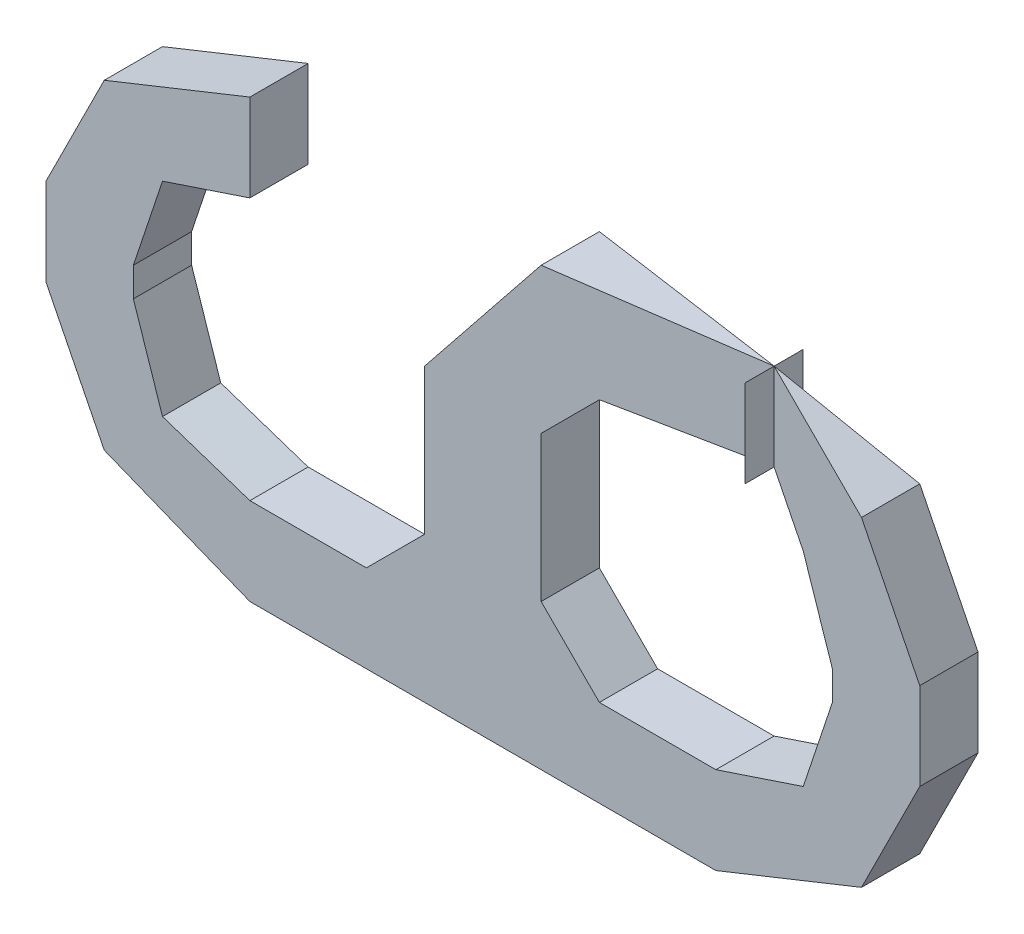
ISO-10303-21;
HEADER;
FILE_DESCRIPTION(('STEP AP214'),'2;1');
FILE_NAME('part.step','',(''),(''),'','','');
FILE_SCHEMA(('AUTOMOTIVE_DESIGN { 1 0 10303 214 1 1 1 1 }'));
ENDSEC;
DATA;
#1=APPLICATION_CONTEXT('core data for automotive mechanical design processes');
#2=APPLICATION_PROTOCOL_DEFINITION('international standard','automotive_design',2000,#1);
#3=PRODUCT_CONTEXT('',#1,'mechanical');
#4=PRODUCT('Part','Part','',(#3));
#5=PRODUCT_RELATED_PRODUCT_CATEGORY('part','',(#4));
#6=PRODUCT_DEFINITION_FORMATION('','',#4);
#7=PRODUCT_DEFINITION_CONTEXT('part definition',#1,'design');
#8=PRODUCT_DEFINITION('design','',#6,#7);
#9=PRODUCT_DEFINITION_SHAPE('','',#8);
#10=(LENGTH_UNIT() NAMED_UNIT(*) SI_UNIT(.MILLI.,.METRE.));
#11=(NAMED_UNIT(*) PLANE_ANGLE_UNIT() SI_UNIT($,.RADIAN.));
#12=(NAMED_UNIT(*) SI_UNIT($,.STERADIAN.) SOLID_ANGLE_UNIT());
#13=UNCERTAINTY_MEASURE_WITH_UNIT(LENGTH_MEASURE(1.E-05),#10,'distance_accuracy_value','');
#14=(GEOMETRIC_REPRESENTATION_CONTEXT(3) GLOBAL_UNCERTAINTY_ASSIGNED_CONTEXT((#13)) GLOBAL_UNIT_ASSIGNED_CONTEXT((#10,
#11,#12)) REPRESENTATION_CONTEXT('',''));
#15=CARTESIAN_POINT('',(0.,0.,0.));
#16=DIRECTION('',(0.,0.,1.));
#17=DIRECTION('',(1.,0.,0.));
#18=AXIS2_PLACEMENT_3D('',#15,#16,#17);
#19=CARTESIAN_POINT('',(-0.1016,0.09524999999999,0.));
#20=DIRECTION('',(0.,0.,-1.));
#21=DIRECTION('',(-1.,0.,0.));
#22=AXIS2_PLACEMENT_3D('',#19,#20,#21);
#23=PLANE('',#22);
#24=DIRECTION('',(0.,1.,0.));
#25=VECTOR('',#24,1.);
#26=CARTESIAN_POINT('',(-0.0254,0.09524999999999,0.));
#27=LINE('',#26,#25);
#28=CARTESIAN_POINT('',(-0.0254,-0.03174999999999,0.));
#29=VERTEX_POINT('',#28);
#30=CARTESIAN_POINT('',(-0.0254000000000053,0.0317500000000285,0.));
#31=VERTEX_POINT('',#30);
#32=EDGE_CURVE('P0_E340',#29,#31,#27,.T.);
#33=ORIENTED_EDGE('',*,*,#32,.T.);
#34=DIRECTION('',(0.624695047554529,0.780868809442946,0.));
#35=VECTOR('',#34,1.);
#36=CARTESIAN_POINT('',(-0.0254,0.03175000000002,0.));
#37=LINE('',#36,#35);
#38=CARTESIAN_POINT('',(0.02539999999999,0.09524999999999,0.));
#39=VERTEX_POINT('',#38);
#40=EDGE_CURVE('P0_E335',#31,#39,#37,.T.);
#41=ORIENTED_EDGE('',*,*,#40,.T.);
#42=DIRECTION('',(-1.,0.,0.));
#43=VECTOR('',#42,1.);
#44=CARTESIAN_POINT('',(-0.1016,0.09524999999999,0.));
#45=LINE('',#44,#43);
#46=CARTESIAN_POINT('',(0.114300000000001,0.095249999999992,0.0127));
#47=VERTEX_POINT('',#46);
#48=EDGE_CURVE('P0_E400',#39,#47,#45,.F.);
#49=ORIENTED_EDGE('',*,*,#48,.T.);
#50=DIRECTION('',(0.894427190999986,-0.447213595499817,0.));
#51=VECTOR('',#50,1.);
#52=CARTESIAN_POINT('',(0.1143,0.09524999999999,0.));
#53=LINE('',#52,#51);
#54=CARTESIAN_POINT('',(0.165099999999998,0.0698499999999998,0.));
#55=VERTEX_POINT('',#54);
#56=EDGE_CURVE('P0_E398',#47,#55,#53,.T.);
#57=ORIENTED_EDGE('',*,*,#56,.T.);
#58=DIRECTION('',(0.447213595499887,-0.894427190999951,0.));
#59=VECTOR('',#58,1.);
#60=CARTESIAN_POINT('',(0.1651,0.06985,0.));
#61=LINE('',#60,#59);
#62=CARTESIAN_POINT('',(0.1905,0.01904999999999,0.));
#63=VERTEX_POINT('',#62);
#64=EDGE_CURVE('P0_E395',#55,#63,#61,.T.);
#65=ORIENTED_EDGE('',*,*,#64,.T.);
#66=DIRECTION('',(0.,1.,0.));
#67=VECTOR('',#66,1.);
#68=CARTESIAN_POINT('',(0.1905,0.09524999999999,0.));
#69=LINE('',#68,#67);
#70=CARTESIAN_POINT('',(0.190500000000001,-0.019049999999991,0.));
#71=VERTEX_POINT('',#70);
#72=EDGE_CURVE('P0_E392',#63,#71,#69,.F.);
#73=ORIENTED_EDGE('',*,*,#72,.T.);
#74=DIRECTION('',(-0.447213595499887,-0.894427190999951,0.));
#75=VECTOR('',#74,1.);
#76=CARTESIAN_POINT('',(0.1905,-0.01904999999999,0.));
#77=LINE('',#76,#75);
#78=CARTESIAN_POINT('',(0.1651,-0.0698499999999965,0.));
#79=VERTEX_POINT('',#78);
#80=EDGE_CURVE('P0_E389',#71,#79,#77,.T.);
#81=ORIENTED_EDGE('',*,*,#80,.T.);
#82=DIRECTION('',(-0.92847669088531,-0.371390676353978,0.));
#83=VECTOR('',#82,1.);
#84=CARTESIAN_POINT('',(0.1651,-0.06985,0.));
#85=LINE('',#84,#83);
#86=CARTESIAN_POINT('',(0.1016,-0.09524999999999,0.));
#87=VERTEX_POINT('',#86);
#88=EDGE_CURVE('P0_E386',#79,#87,#85,.T.);
#89=ORIENTED_EDGE('',*,*,#88,.T.);
#90=DIRECTION('',(-1.,0.,0.));
#91=VECTOR('',#90,1.);
#92=CARTESIAN_POINT('',(-0.1016,-0.09524999999999,0.));
#93=LINE('',#92,#91);
#94=CARTESIAN_POINT('',(-0.101600000000002,-0.0952499999999921,0.));
#95=VERTEX_POINT('',#94);
#96=EDGE_CURVE('P0_E383',#87,#95,#93,.T.);
#97=ORIENTED_EDGE('',*,*,#96,.T.);
#98=DIRECTION('',(-0.92847669088531,0.371390676353978,0.));
#99=VECTOR('',#98,1.);
#100=CARTESIAN_POINT('',(-0.1016,-0.09524999999999,0.));
#101=LINE('',#100,#99);
#102=CARTESIAN_POINT('',(-0.165099999999998,-0.0698499999999998,0.));
#103=VERTEX_POINT('',#102);
#104=EDGE_CURVE('P0_E380',#95,#103,#101,.T.);
#105=ORIENTED_EDGE('',*,*,#104,.T.);
#106=DIRECTION('',(-0.447213595499888,0.894427190999951,0.));
#107=VECTOR('',#106,1.);
#108=CARTESIAN_POINT('',(-0.1651,-0.06985,0.));
#109=LINE('',#108,#107);
#110=CARTESIAN_POINT('',(-0.1905,-0.01904999999999,0.));
#111=VERTEX_POINT('',#110);
#112=EDGE_CURVE('P0_E377',#103,#111,#109,.T.);
#113=ORIENTED_EDGE('',*,*,#112,.T.);
#114=DIRECTION('',(0.,1.,0.));
#115=VECTOR('',#114,1.);
#116=CARTESIAN_POINT('',(-0.1905,0.09524999999999,0.));
#117=LINE('',#116,#115);
#118=CARTESIAN_POINT('',(-0.190500000000001,0.019049999999991,0.));
#119=VERTEX_POINT('',#118);
#120=EDGE_CURVE('P0_E374',#111,#119,#117,.T.);
#121=ORIENTED_EDGE('',*,*,#120,.T.);
#122=DIRECTION('',(0.447213595499888,0.894427190999951,0.));
#123=VECTOR('',#122,1.);
#124=CARTESIAN_POINT('',(-0.1905,0.01904999999999,0.));
#125=LINE('',#124,#123);
#126=CARTESIAN_POINT('',(-0.1651,0.0698499999999965,0.));
#127=VERTEX_POINT('',#126);
#128=EDGE_CURVE('P0_E371',#119,#127,#125,.T.);
#129=ORIENTED_EDGE('',*,*,#128,.T.);
#130=DIRECTION('',(0.92847669088531,0.371390676353978,0.));
#131=VECTOR('',#130,1.);
#132=CARTESIAN_POINT('',(-0.1651,0.06985,0.));
#133=LINE('',#132,#131);
#134=CARTESIAN_POINT('',(-0.1016,0.09524999999999,0.));
#135=VERTEX_POINT('',#134);
#136=EDGE_CURVE('P0_E368',#127,#135,#133,.T.);
#137=ORIENTED_EDGE('',*,*,#136,.T.);
#138=DIRECTION('',(0.,1.,0.));
#139=VECTOR('',#138,1.);
#140=CARTESIAN_POINT('',(-0.1016,0.09524999999999,0.));
#141=LINE('',#140,#139);
#142=CARTESIAN_POINT('',(-0.1016,0.05715000000001,0.));
#143=VERTEX_POINT('',#142);
#144=EDGE_CURVE('P0_E365',#135,#143,#141,.F.);
#145=ORIENTED_EDGE('',*,*,#144,.T.);
#146=DIRECTION('',(-0.948683298050514,-0.316227766016838,0.));
#147=VECTOR('',#146,1.);
#148=CARTESIAN_POINT('',(-0.1016,0.05715000000001,0.));
#149=LINE('',#148,#147);
#150=CARTESIAN_POINT('',(-0.139699999999998,0.0444500000000099,0.));
#151=VERTEX_POINT('',#150);
#152=EDGE_CURVE('P0_E362',#143,#151,#149,.T.);
#153=ORIENTED_EDGE('',*,*,#152,.T.);
#154=DIRECTION('',(-0.316227766016749,-0.948683298050543,0.));
#155=VECTOR('',#154,1.);
#156=CARTESIAN_POINT('',(-0.1397,0.04445000000001,0.));
#157=LINE('',#156,#155);
#158=CARTESIAN_POINT('',(-0.1524,0.00634999999999801,0.));
#159=VERTEX_POINT('',#158);
#160=EDGE_CURVE('P0_E359',#151,#159,#157,.T.);
#161=ORIENTED_EDGE('',*,*,#160,.T.);
#162=DIRECTION('',(0.,1.,0.));
#163=VECTOR('',#162,1.);
#164=CARTESIAN_POINT('',(-0.1524,0.09524999999999,0.));
#165=LINE('',#164,#163);
#166=CARTESIAN_POINT('',(-0.152399999999999,-0.00634999999999722,0.));
#167=VERTEX_POINT('',#166);
#168=EDGE_CURVE('P0_E356',#159,#167,#165,.F.);
#169=ORIENTED_EDGE('',*,*,#168,.T.);
#170=DIRECTION('',(0.316227766016973,-0.948683298050469,0.));
#171=VECTOR('',#170,1.);
#172=CARTESIAN_POINT('',(-0.1524,-0.006349999999998,0.));
#173=LINE('',#172,#171);
#174=CARTESIAN_POINT('',(-0.1397,-0.0444499999999867,0.));
#175=VERTEX_POINT('',#174);
#176=EDGE_CURVE('P0_E353',#167,#175,#173,.T.);
#177=ORIENTED_EDGE('',*,*,#176,.T.);
#178=DIRECTION('',(0.94868329805029,-0.31622776601751,0.));
#179=VECTOR('',#178,1.);
#180=CARTESIAN_POINT('',(-0.1397,-0.04444999999998,0.));
#181=LINE('',#180,#179);
#182=CARTESIAN_POINT('',(-0.1016,-0.05715000000001,0.));
#183=VERTEX_POINT('',#182);
#184=EDGE_CURVE('P0_E350',#175,#183,#181,.T.);
#185=ORIENTED_EDGE('',*,*,#184,.T.);
#186=DIRECTION('',(-1.,0.,0.));
#187=VECTOR('',#186,1.);
#188=CARTESIAN_POINT('',(-0.1016,-0.05715000000001,0.));
#189=LINE('',#188,#187);
#190=CARTESIAN_POINT('',(-0.0508000000000035,-0.0571500000000132,0.));
#191=VERTEX_POINT('',#190);
#192=EDGE_CURVE('P0_E347',#183,#191,#189,.F.);
#193=ORIENTED_EDGE('',*,*,#192,.T.);
#194=DIRECTION('',(0.707106781186408,0.707106781186687,0.));
#195=VECTOR('',#194,1.);
#196=CARTESIAN_POINT('',(-0.05080000000001,-0.05715000000001,0.));
#197=LINE('',#196,#195);
#198=EDGE_CURVE('P0_E344',#191,#29,#197,.T.);
#199=ORIENTED_EDGE('',*,*,#198,.T.);
#200=EDGE_LOOP('',(#33,#41,#49,#57,#65,#73,#81,#89,#97,#105,#113,#121,#129,#137,#145,#153,#161,
#169,#177,#185,#193,#199));
#201=FACE_BOUND('',#200,.T.);
#202=DIRECTION('',(-0.316227766016749,0.948683298050544,0.));
#203=VECTOR('',#202,1.);
#204=CARTESIAN_POINT('',(0.1524,0.006349999999998,0.));
#205=LINE('',#204,#203);
#206=CARTESIAN_POINT('',(0.152400000000004,0.00635000000000065,0.));
#207=VERTEX_POINT('',#206);
#208=CARTESIAN_POINT('',(0.1397,0.04445000000001,0.));
#209=VERTEX_POINT('',#208);
#210=EDGE_CURVE('P0_E411',#207,#209,#205,.T.);
#211=ORIENTED_EDGE('',*,*,#210,.T.);
#212=DIRECTION('',(-0.894427190999916,0.447213595499958,0.));
#213=VECTOR('',#212,1.);
#214=CARTESIAN_POINT('',(0.1397,0.04445000000001,0.));
#215=LINE('',#214,#213);
#216=CARTESIAN_POINT('',(0.1143,0.05715000000001,0.0127));
#217=VERTEX_POINT('',#216);
#218=EDGE_CURVE('P0_E221',#209,#217,#215,.T.);
#219=ORIENTED_EDGE('',*,*,#218,.T.);
#220=DIRECTION('',(-1.,0.,0.));
#221=VECTOR('',#220,1.);
#222=CARTESIAN_POINT('',(-0.1016,0.05715000000001,0.));
#223=LINE('',#222,#221);
#224=CARTESIAN_POINT('',(0.050800000000004,0.057150000000008,0.));
#225=VERTEX_POINT('',#224);
#226=EDGE_CURVE('P0_E219',#217,#225,#223,.T.);
#227=ORIENTED_EDGE('',*,*,#226,.T.);
#228=DIRECTION('',(-0.707106781186826,-0.707106781186269,0.));
#229=VECTOR('',#228,1.);
#230=CARTESIAN_POINT('',(0.0508,0.05715000000001,0.));
#231=LINE('',#230,#229);
#232=CARTESIAN_POINT('',(0.02539999999999,0.03175000000002,0.));
#233=VERTEX_POINT('',#232);
#234=EDGE_CURVE('P0_E215',#225,#233,#231,.T.);
#235=ORIENTED_EDGE('',*,*,#234,.T.);
#236=DIRECTION('',(0.,1.,0.));
#237=VECTOR('',#236,1.);
#238=CARTESIAN_POINT('',(0.02539999999999,0.09524999999999,0.));
#239=LINE('',#238,#237);
#240=CARTESIAN_POINT('',(0.0253999999999932,-0.0317499999999835,0.));
#241=VERTEX_POINT('',#240);
#242=EDGE_CURVE('P0_E429',#233,#241,#239,.F.);
#243=ORIENTED_EDGE('',*,*,#242,.T.);
#244=DIRECTION('',(0.707106781186409,-0.707106781186686,0.));
#245=VECTOR('',#244,1.);
#246=CARTESIAN_POINT('',(0.02539999999999,-0.03174999999999,0.));
#247=LINE('',#246,#245);
#248=CARTESIAN_POINT('',(0.0508,-0.05715000000001,0.));
#249=VERTEX_POINT('',#248);
#250=EDGE_CURVE('P0_E426',#241,#249,#247,.T.);
#251=ORIENTED_EDGE('',*,*,#250,.T.);
#252=DIRECTION('',(-1.,0.,0.));
#253=VECTOR('',#252,1.);
#254=CARTESIAN_POINT('',(-0.1016,-0.05715000000001,0.));
#255=LINE('',#254,#253);
#256=CARTESIAN_POINT('',(0.101599999999998,-0.0571500000000062,0.));
#257=VERTEX_POINT('',#256);
#258=EDGE_CURVE('P0_E423',#249,#257,#255,.F.);
#259=ORIENTED_EDGE('',*,*,#258,.T.);
#260=DIRECTION('',(0.94868329805029,0.31622776601751,0.));
#261=VECTOR('',#260,1.);
#262=CARTESIAN_POINT('',(0.1016,-0.05715000000001,0.));
#263=LINE('',#262,#261);
#264=CARTESIAN_POINT('',(0.139699999999997,-0.0444499999999799,0.));
#265=VERTEX_POINT('',#264);
#266=EDGE_CURVE('P0_E420',#257,#265,#263,.T.);
#267=ORIENTED_EDGE('',*,*,#266,.T.);
#268=DIRECTION('',(0.316227766016973,0.948683298050469,0.));
#269=VECTOR('',#268,1.);
#270=CARTESIAN_POINT('',(0.1397,-0.04444999999998,0.));
#271=LINE('',#270,#269);
#272=CARTESIAN_POINT('',(0.1524,-0.00634999999999794,0.));
#273=VERTEX_POINT('',#272);
#274=EDGE_CURVE('P0_E417',#265,#273,#271,.T.);
#275=ORIENTED_EDGE('',*,*,#274,.T.);
#276=DIRECTION('',(0.,1.,0.));
#277=VECTOR('',#276,1.);
#278=CARTESIAN_POINT('',(0.1524,0.09524999999999,0.));
#279=LINE('',#278,#277);
#280=EDGE_CURVE('P0_E414',#273,#207,#279,.T.);
#281=ORIENTED_EDGE('',*,*,#280,.T.);
#282=EDGE_LOOP('',(#211,#219,#227,#235,#243,#251,#259,#267,#275,#281));
#283=FACE_BOUND('',#282,.T.);
#284=ADVANCED_FACE('P0_F17',(#201,#283),#23,.T.);
#285=CARTESIAN_POINT('',(0.0508,0.05715000000001,0.));
#286=DIRECTION('',(0.,1.,0.));
#287=DIRECTION('',(0.,0.,1.));
#288=AXIS2_PLACEMENT_3D('',#285,#286,#287);
#289=PLANE('',#288);
#290=DIRECTION('',(1.,0.,0.));
#291=VECTOR('',#290,1.);
#292=CARTESIAN_POINT('',(0.0508,0.05715000000001,0.0254));
#293=LINE('',#292,#291);
#294=CARTESIAN_POINT('',(0.0508000000000119,0.057150000000006,0.0254));
#295=VERTEX_POINT('',#294);
#296=EDGE_CURVE('P0_E235',#217,#295,#293,.F.);
#297=ORIENTED_EDGE('',*,*,#296,.T.);
#298=DIRECTION('',(0.,0.,1.));
#299=VECTOR('',#298,1.);
#300=CARTESIAN_POINT('',(0.050800000000008,0.057150000000002,0.));
#301=LINE('',#300,#299);
#302=EDGE_CURVE('P0_E226',#295,#225,#301,.F.);
#303=ORIENTED_EDGE('',*,*,#302,.T.);
#304=ORIENTED_EDGE('',*,*,#226,.F.);
#305=EDGE_LOOP('',(#297,#303,#304));
#306=FACE_BOUND('',#305,.T.);
#307=ADVANCED_FACE('P0_F234',(#306),#289,.F.);
#308=CARTESIAN_POINT('',(0.02539999999999,0.03175000000002,0.));
#309=DIRECTION('',(-0.707106781186048,0.707106781187048,0.));
#310=DIRECTION('',(-0.707106781187048,-0.707106781186048,0.));
#311=AXIS2_PLACEMENT_3D('',#308,#309,#310);
#312=PLANE('',#311);
#313=ORIENTED_EDGE('',*,*,#302,.F.);
#314=DIRECTION('',(-0.707106781187048,-0.707106781186048,0.));
#315=VECTOR('',#314,1.);
#316=CARTESIAN_POINT('',(0.02539999999999,0.03175000000002,0.0254));
#317=LINE('',#316,#315);
#318=CARTESIAN_POINT('',(0.02539999999999,0.03175000000002,0.0254));
#319=VERTEX_POINT('',#318);
#320=EDGE_CURVE('P0_E332',#295,#319,#317,.T.);
#321=ORIENTED_EDGE('',*,*,#320,.T.);
#322=DIRECTION('',(0.,0.,1.));
#323=VECTOR('',#322,1.);
#324=CARTESIAN_POINT('',(0.02539999999999,0.03175000000002,0.));
#325=LINE('',#324,#323);
#326=EDGE_CURVE('P0_E232',#319,#233,#325,.F.);
#327=ORIENTED_EDGE('',*,*,#326,.T.);
#328=ORIENTED_EDGE('',*,*,#234,.F.);
#329=EDGE_LOOP('',(#313,#321,#327,#328));
#330=FACE_BOUND('',#329,.T.);
#331=ADVANCED_FACE('P0_F229',(#330),#312,.F.);
#332=CARTESIAN_POINT('',(0.02539999999999,-0.03174999999999,0.));
#333=DIRECTION('',(-1.,0.,0.));
#334=DIRECTION('',(0.,0.,1.));
#335=AXIS2_PLACEMENT_3D('',#332,#333,#334);
#336=PLANE('',#335);
#337=ORIENTED_EDGE('',*,*,#326,.F.);
#338=DIRECTION('',(0.,1.,0.));
#339=VECTOR('',#338,1.);
#340=CARTESIAN_POINT('',(0.02539999999999,-0.03174999999999,0.0254));
#341=LINE('',#340,#339);
#342=CARTESIAN_POINT('',(0.0253999999999965,-0.0317499999999706,0.0254));
#343=VERTEX_POINT('',#342);
#344=EDGE_CURVE('P0_E329',#319,#343,#341,.F.);
#345=ORIENTED_EDGE('',*,*,#344,.T.);
#346=DIRECTION('',(0.,0.,1.));
#347=VECTOR('',#346,1.);
#348=CARTESIAN_POINT('',(0.025400000000003,-0.031749999999977,0.));
#349=LINE('',#348,#347);
#350=EDGE_CURVE('P0_E428',#343,#241,#349,.F.);
#351=ORIENTED_EDGE('',*,*,#350,.T.);
#352=ORIENTED_EDGE('',*,*,#242,.F.);
#353=EDGE_LOOP('',(#337,#345,#351,#352));
#354=FACE_BOUND('',#353,.T.);
#355=ADVANCED_FACE('P0_F655',(#354),#336,.F.);
#356=CARTESIAN_POINT('',(0.0508,-0.05715000000001,0.));
#357=DIRECTION('',(-0.707106781187048,-0.707106781186048,0.));
#358=DIRECTION('',(0.707106781186048,-0.707106781187048,0.));
#359=AXIS2_PLACEMENT_3D('',#356,#357,#358);
#360=PLANE('',#359);
#361=ORIENTED_EDGE('',*,*,#350,.F.);
#362=DIRECTION('',(0.707106781186048,-0.707106781187048,0.));
#363=VECTOR('',#362,1.);
#364=CARTESIAN_POINT('',(0.0508,-0.05715000000001,0.0254));
#365=LINE('',#364,#363);
#366=CARTESIAN_POINT('',(0.0508,-0.05715000000001,0.0254));
#367=VERTEX_POINT('',#366);
#368=EDGE_CURVE('P0_E326',#343,#367,#365,.T.);
#369=ORIENTED_EDGE('',*,*,#368,.T.);
#370=DIRECTION('',(0.,0.,-1.));
#371=VECTOR('',#370,1.);
#372=CARTESIAN_POINT('',(0.0508,-0.05715000000001,0.));
#373=LINE('',#372,#371);
#374=EDGE_CURVE('P0_E425',#367,#249,#373,.T.);
#375=ORIENTED_EDGE('',*,*,#374,.T.);
#376=ORIENTED_EDGE('',*,*,#250,.F.);
#377=EDGE_LOOP('',(#361,#369,#375,#376));
#378=FACE_BOUND('',#377,.T.);
#379=ADVANCED_FACE('P0_F651',(#378),#360,.F.);
#380=CARTESIAN_POINT('',(0.1016,-0.05715000000001,0.));
#381=DIRECTION('',(0.,-1.,0.));
#382=DIRECTION('',(0.,0.,-1.));
#383=AXIS2_PLACEMENT_3D('',#380,#381,#382);
#384=PLANE('',#383);
#385=ORIENTED_EDGE('',*,*,#374,.F.);
#386=DIRECTION('',(1.,0.,0.));
#387=VECTOR('',#386,1.);
#388=CARTESIAN_POINT('',(0.1016,-0.05715000000001,0.0254));
#389=LINE('',#388,#387);
#390=CARTESIAN_POINT('',(0.101599999999973,-0.0571500000000025,0.0254));
#391=VERTEX_POINT('',#390);
#392=EDGE_CURVE('P0_E323',#367,#391,#389,.T.);
#393=ORIENTED_EDGE('',*,*,#392,.T.);
#394=DIRECTION('',(0.,0.,1.));
#395=VECTOR('',#394,1.);
#396=CARTESIAN_POINT('',(0.101599999999995,-0.057149999999995,0.));
#397=LINE('',#396,#395);
#398=EDGE_CURVE('P0_E422',#391,#257,#397,.F.);
#399=ORIENTED_EDGE('',*,*,#398,.T.);
#400=ORIENTED_EDGE('',*,*,#258,.F.);
#401=EDGE_LOOP('',(#385,#393,#399,#400));
#402=FACE_BOUND('',#401,.T.);
#403=ADVANCED_FACE('P0_F647',(#402),#384,.F.);
#404=CARTESIAN_POINT('',(0.1397,-0.04444999999998,0.));
#405=DIRECTION('',(0.316227766017138,-0.948683298050414,0.));
#406=DIRECTION('',(0.948683298050414,0.316227766017138,0.));
#407=AXIS2_PLACEMENT_3D('',#404,#405,#406);
#408=PLANE('',#407);
#409=ORIENTED_EDGE('',*,*,#398,.F.);
#410=DIRECTION('',(0.948683298050414,0.316227766017138,0.));
#411=VECTOR('',#410,1.);
#412=CARTESIAN_POINT('',(0.1397,-0.04444999999998,0.0254));
#413=LINE('',#412,#411);
#414=CARTESIAN_POINT('',(0.139699999999993,-0.0444499999999803,0.0254));
#415=VERTEX_POINT('',#414);
#416=EDGE_CURVE('P0_E320',#391,#415,#413,.T.);
#417=ORIENTED_EDGE('',*,*,#416,.T.);
#418=DIRECTION('',(0.,0.,1.));
#419=VECTOR('',#418,1.);
#420=CARTESIAN_POINT('',(0.139699999999993,-0.0444499999999778,0.));
#421=LINE('',#420,#419);
#422=EDGE_CURVE('P0_E419',#415,#265,#421,.F.);
#423=ORIENTED_EDGE('',*,*,#422,.T.);
#424=ORIENTED_EDGE('',*,*,#266,.F.);
#425=EDGE_LOOP('',(#409,#417,#423,#424));
#426=FACE_BOUND('',#425,.T.);
#427=ADVANCED_FACE('P0_F643',(#426),#408,.F.);
#428=CARTESIAN_POINT('',(0.1524,-0.006349999999998,0.));
#429=DIRECTION('',(0.948683298050414,-0.316227766017138,0.));
#430=DIRECTION('',(0.316227766017138,0.948683298050414,0.));
#431=AXIS2_PLACEMENT_3D('',#428,#429,#430);
#432=PLANE('',#431);
#433=ORIENTED_EDGE('',*,*,#422,.F.);
#434=DIRECTION('',(0.316227766017138,0.948683298050414,0.));
#435=VECTOR('',#434,1.);
#436=CARTESIAN_POINT('',(0.1524,-0.006349999999998,0.0254));
#437=LINE('',#436,#435);
#438=CARTESIAN_POINT('',(0.1524,-0.00634999999999799,0.0254));
#439=VERTEX_POINT('',#438);
#440=EDGE_CURVE('P0_E317',#415,#439,#437,.T.);
#441=ORIENTED_EDGE('',*,*,#440,.T.);
#442=DIRECTION('',(0.,0.,-1.));
#443=VECTOR('',#442,1.);
#444=CARTESIAN_POINT('',(0.1524,-0.006349999999998,0.));
#445=LINE('',#444,#443);
#446=EDGE_CURVE('P0_E416',#439,#273,#445,.T.);
#447=ORIENTED_EDGE('',*,*,#446,.T.);
#448=ORIENTED_EDGE('',*,*,#274,.F.);
#449=EDGE_LOOP('',(#433,#441,#447,#448));
#450=FACE_BOUND('',#449,.T.);
#451=ADVANCED_FACE('P0_F639',(#450),#432,.F.);
#452=CARTESIAN_POINT('',(0.1524,0.006349999999998,0.));
#453=DIRECTION('',(1.,0.,0.));
#454=DIRECTION('',(0.,0.,-1.));
#455=AXIS2_PLACEMENT_3D('',#452,#453,#454);
#456=PLANE('',#455);
#457=ORIENTED_EDGE('',*,*,#446,.F.);
#458=DIRECTION('',(0.,1.,0.));
#459=VECTOR('',#458,1.);
#460=CARTESIAN_POINT('',(0.1524,0.006349999999998,0.0254));
#461=LINE('',#460,#459);
#462=CARTESIAN_POINT('',(0.152400000000008,0.00635000000002664,0.0254));
#463=VERTEX_POINT('',#462);
#464=EDGE_CURVE('P0_E314',#439,#463,#461,.T.);
#465=ORIENTED_EDGE('',*,*,#464,.T.);
#466=DIRECTION('',(0.,0.,1.));
#467=VECTOR('',#466,1.);
#468=CARTESIAN_POINT('',(0.152400000000016,0.0063500000000032,0.));
#469=LINE('',#468,#467);
#470=EDGE_CURVE('P0_E413',#463,#207,#469,.F.);
#471=ORIENTED_EDGE('',*,*,#470,.T.);
#472=ORIENTED_EDGE('',*,*,#280,.F.);
#473=EDGE_LOOP('',(#457,#465,#471,#472));
#474=FACE_BOUND('',#473,.T.);
#475=ADVANCED_FACE('P0_F635',(#474),#456,.F.);
#476=CARTESIAN_POINT('',(0.1397,0.04445000000001,0.));
#477=DIRECTION('',(0.948683298050414,0.316227766017138,0.));
#478=DIRECTION('',(-0.316227766017138,0.948683298050414,0.));
#479=AXIS2_PLACEMENT_3D('',#476,#477,#478);
#480=PLANE('',#479);
#481=ORIENTED_EDGE('',*,*,#470,.F.);
#482=DIRECTION('',(-0.316227766017138,0.948683298050414,0.));
#483=VECTOR('',#482,1.);
#484=CARTESIAN_POINT('',(0.1397,0.04445000000001,0.0254));
#485=LINE('',#484,#483);
#486=CARTESIAN_POINT('',(0.1397,0.04445000000001,0.0254));
#487=VERTEX_POINT('',#486);
#488=EDGE_CURVE('P0_E309',#463,#487,#485,.T.);
#489=ORIENTED_EDGE('',*,*,#488,.T.);
#490=DIRECTION('',(0.,0.,1.));
#491=VECTOR('',#490,1.);
#492=CARTESIAN_POINT('',(0.1397,0.04445000000001,0.));
#493=LINE('',#492,#491);
#494=EDGE_CURVE('P0_E408',#487,#209,#493,.F.);
#495=ORIENTED_EDGE('',*,*,#494,.T.);
#496=ORIENTED_EDGE('',*,*,#210,.F.);
#497=EDGE_LOOP('',(#481,#489,#495,#496));
#498=FACE_BOUND('',#497,.T.);
#499=ADVANCED_FACE('P0_F631',(#498),#480,.F.);
#500=CARTESIAN_POINT('',(0.1143,0.05715000000001,0.));
#501=DIRECTION('',(0.447213595499958,0.894427190999916,0.));
#502=DIRECTION('',(-0.894427190999916,0.447213595499958,0.));
#503=AXIS2_PLACEMENT_3D('',#500,#501,#502);
#504=PLANE('',#503);
#505=ORIENTED_EDGE('',*,*,#494,.F.);
#506=DIRECTION('',(-0.894427190999916,0.447213595499958,0.));
#507=VECTOR('',#506,1.);
#508=CARTESIAN_POINT('',(0.1143,0.05715000000001,0.0254));
#509=LINE('',#508,#507);
#510=EDGE_CURVE('P0_E304',#487,#217,#509,.T.);
#511=ORIENTED_EDGE('',*,*,#510,.T.);
#512=ORIENTED_EDGE('',*,*,#218,.F.);
#513=EDGE_LOOP('',(#505,#511,#512));
#514=FACE_BOUND('',#513,.T.);
#515=ADVANCED_FACE('P0_F628',(#514),#504,.F.);
#516=CARTESIAN_POINT('',(0.1143,0.09524999999999,0.));
#517=DIRECTION('',(0.,-1.,0.));
#518=DIRECTION('',(0.,0.,-1.));
#519=AXIS2_PLACEMENT_3D('',#516,#517,#518);
#520=PLANE('',#519);
#521=DIRECTION('',(0.,0.,1.));
#522=VECTOR('',#521,1.);
#523=CARTESIAN_POINT('',(0.02539999999999,0.09524999999999,0.));
#524=LINE('',#523,#522);
#525=CARTESIAN_POINT('',(0.02539999999999,0.09524999999999,0.0254));
#526=VERTEX_POINT('',#525);
#527=EDGE_CURVE('P0_E342',#39,#526,#524,.T.);
#528=ORIENTED_EDGE('',*,*,#527,.T.);
#529=DIRECTION('',(1.,0.,0.));
#530=VECTOR('',#529,1.);
#531=CARTESIAN_POINT('',(0.1143,0.09524999999999,0.0254));
#532=LINE('',#531,#530);
#533=EDGE_CURVE('P0_E299',#526,#47,#532,.T.);
#534=ORIENTED_EDGE('',*,*,#533,.T.);
#535=ORIENTED_EDGE('',*,*,#48,.F.);
#536=EDGE_LOOP('',(#528,#534,#535));
#537=FACE_BOUND('',#536,.T.);
#538=ADVANCED_FACE('P0_F488',(#537),#520,.F.);
#539=CARTESIAN_POINT('',(0.1651,0.06985,0.));
#540=DIRECTION('',(-0.447213595499958,-0.894427190999916,0.));
#541=DIRECTION('',(0.894427190999916,-0.447213595499958,0.));
#542=AXIS2_PLACEMENT_3D('',#539,#540,#541);
#543=PLANE('',#542);
#544=DIRECTION('',(0.894427190999916,-0.447213595499958,0.));
#545=VECTOR('',#544,1.);
#546=CARTESIAN_POINT('',(0.1651,0.06985,0.0254));
#547=LINE('',#546,#545);
#548=CARTESIAN_POINT('',(0.165099999999995,0.0698500000000007,0.0254));
#549=VERTEX_POINT('',#548);
#550=EDGE_CURVE('P0_E296',#47,#549,#547,.T.);
#551=ORIENTED_EDGE('',*,*,#550,.T.);
#552=DIRECTION('',(0.,0.,1.));
#553=VECTOR('',#552,1.);
#554=CARTESIAN_POINT('',(0.165099999999996,0.069849999999998,0.));
#555=LINE('',#554,#553);
#556=EDGE_CURVE('P0_E397',#549,#55,#555,.F.);
#557=ORIENTED_EDGE('',*,*,#556,.T.);
#558=ORIENTED_EDGE('',*,*,#56,.F.);
#559=EDGE_LOOP('',(#551,#557,#558));
#560=FACE_BOUND('',#559,.T.);
#561=ADVANCED_FACE('P0_F572',(#560),#543,.F.);
#562=CARTESIAN_POINT('',(0.1905,0.01904999999999,0.));
#563=DIRECTION('',(-0.894427190999916,-0.447213595499958,0.));
#564=DIRECTION('',(0.447213595499958,-0.894427190999916,0.));
#565=AXIS2_PLACEMENT_3D('',#562,#563,#564);
#566=PLANE('',#565);
#567=ORIENTED_EDGE('',*,*,#556,.F.);
#568=DIRECTION('',(0.447213595499958,-0.894427190999916,0.));
#569=VECTOR('',#568,1.);
#570=CARTESIAN_POINT('',(0.1905,0.01904999999999,0.0254));
#571=LINE('',#570,#569);
#572=CARTESIAN_POINT('',(0.1905,0.01904999999999,0.0254));
#573=VERTEX_POINT('',#572);
#574=EDGE_CURVE('P0_E293',#549,#573,#571,.T.);
#575=ORIENTED_EDGE('',*,*,#574,.T.);
#576=DIRECTION('',(0.,0.,1.));
#577=VECTOR('',#576,1.);
#578=CARTESIAN_POINT('',(0.1905,0.01904999999999,0.));
#579=LINE('',#578,#577);
#580=EDGE_CURVE('P0_E394',#573,#63,#579,.F.);
#581=ORIENTED_EDGE('',*,*,#580,.T.);
#582=ORIENTED_EDGE('',*,*,#64,.F.);
#583=EDGE_LOOP('',(#567,#575,#581,#582));
#584=FACE_BOUND('',#583,.T.);
#585=ADVANCED_FACE('P0_F568',(#584),#566,.F.);
#586=CARTESIAN_POINT('',(0.1905,-0.01904999999999,0.));
#587=DIRECTION('',(-1.,0.,0.));
#588=DIRECTION('',(0.,0.,1.));
#589=AXIS2_PLACEMENT_3D('',#586,#587,#588);
#590=PLANE('',#589);
#591=ORIENTED_EDGE('',*,*,#580,.F.);
#592=DIRECTION('',(0.,1.,0.));
#593=VECTOR('',#592,1.);
#594=CARTESIAN_POINT('',(0.1905,-0.01904999999999,0.0254));
#595=LINE('',#594,#593);
#596=CARTESIAN_POINT('',(0.190500000000002,-0.019049999999996,0.0254));
#597=VERTEX_POINT('',#596);
#598=EDGE_CURVE('P0_E290',#573,#597,#595,.F.);
#599=ORIENTED_EDGE('',*,*,#598,.T.);
#600=DIRECTION('',(0.,0.,1.));
#601=VECTOR('',#600,1.);
#602=CARTESIAN_POINT('',(0.190500000000004,-0.019049999999992,0.));
#603=LINE('',#602,#601);
#604=EDGE_CURVE('P0_E391',#597,#71,#603,.F.);
#605=ORIENTED_EDGE('',*,*,#604,.T.);
#606=ORIENTED_EDGE('',*,*,#72,.F.);
#607=EDGE_LOOP('',(#591,#599,#605,#606));
#608=FACE_BOUND('',#607,.T.);
#609=ADVANCED_FACE('P0_F565',(#608),#590,.F.);
#610=CARTESIAN_POINT('',(0.1651,-0.06985,0.));
#611=DIRECTION('',(-0.894427190999916,0.447213595499958,0.));
#612=DIRECTION('',(-0.447213595499958,-0.894427190999916,0.));
#613=AXIS2_PLACEMENT_3D('',#610,#611,#612);
#614=PLANE('',#613);
#615=ORIENTED_EDGE('',*,*,#604,.F.);
#616=DIRECTION('',(-0.447213595499958,-0.894427190999916,0.));
#617=VECTOR('',#616,1.);
#618=CARTESIAN_POINT('',(0.1651,-0.06985,0.0254));
#619=LINE('',#618,#617);
#620=CARTESIAN_POINT('',(0.165100000000001,-0.0698499999999894,0.0254));
#621=VERTEX_POINT('',#620);
#622=EDGE_CURVE('P0_E287',#597,#621,#619,.T.);
#623=ORIENTED_EDGE('',*,*,#622,.T.);
#624=DIRECTION('',(0.,0.,1.));
#625=VECTOR('',#624,1.);
#626=CARTESIAN_POINT('',(0.165099999999997,-0.0698499999999914,0.));
#627=LINE('',#626,#625);
#628=EDGE_CURVE('P0_E388',#621,#79,#627,.F.);
#629=ORIENTED_EDGE('',*,*,#628,.T.);
#630=ORIENTED_EDGE('',*,*,#80,.F.);
#631=EDGE_LOOP('',(#615,#623,#629,#630));
#632=FACE_BOUND('',#631,.T.);
#633=ADVANCED_FACE('P0_F561',(#632),#614,.F.);
#634=CARTESIAN_POINT('',(0.1016,-0.09524999999999,0.));
#635=DIRECTION('',(-0.371390676354104,0.928476690885259,0.));
#636=DIRECTION('',(-0.928476690885259,-0.371390676354104,0.));
#637=AXIS2_PLACEMENT_3D('',#634,#635,#636);
#638=PLANE('',#637);
#639=ORIENTED_EDGE('',*,*,#628,.F.);
#640=DIRECTION('',(-0.928476690885259,-0.371390676354104,0.));
#641=VECTOR('',#640,1.);
#642=CARTESIAN_POINT('',(0.1016,-0.09524999999999,0.0254));
#643=LINE('',#642,#641);
#644=CARTESIAN_POINT('',(0.1016,-0.09524999999999,0.0254));
#645=VERTEX_POINT('',#644);
#646=EDGE_CURVE('P0_E284',#621,#645,#643,.T.);
#647=ORIENTED_EDGE('',*,*,#646,.T.);
#648=DIRECTION('',(0.,0.,1.));
#649=VECTOR('',#648,1.);
#650=CARTESIAN_POINT('',(0.1016,-0.09524999999999,0.));
#651=LINE('',#650,#649);
#652=EDGE_CURVE('P0_E385',#645,#87,#651,.F.);
#653=ORIENTED_EDGE('',*,*,#652,.T.);
#654=ORIENTED_EDGE('',*,*,#88,.F.);
#655=EDGE_LOOP('',(#639,#647,#653,#654));
#656=FACE_BOUND('',#655,.T.);
#657=ADVANCED_FACE('P0_F557',(#656),#638,.F.);
#658=CARTESIAN_POINT('',(-0.1016,-0.09524999999999,0.));
#659=DIRECTION('',(0.,1.,0.));
#660=DIRECTION('',(0.,0.,1.));
#661=AXIS2_PLACEMENT_3D('',#658,#659,#660);
#662=PLANE('',#661);
#663=ORIENTED_EDGE('',*,*,#652,.F.);
#664=DIRECTION('',(1.,0.,0.));
#665=VECTOR('',#664,1.);
#666=CARTESIAN_POINT('',(-0.1016,-0.09524999999999,0.0254));
#667=LINE('',#666,#665);
#668=CARTESIAN_POINT('',(-0.101600000000014,-0.0952499999999943,0.0254));
#669=VERTEX_POINT('',#668);
#670=EDGE_CURVE('P0_E281',#645,#669,#667,.F.);
#671=ORIENTED_EDGE('',*,*,#670,.T.);
#672=DIRECTION('',(0.,0.,1.));
#673=VECTOR('',#672,1.);
#674=CARTESIAN_POINT('',(-0.101600000000003,-0.0952499999999986,0.));
#675=LINE('',#674,#673);
#676=EDGE_CURVE('P0_E382',#669,#95,#675,.F.);
#677=ORIENTED_EDGE('',*,*,#676,.T.);
#678=ORIENTED_EDGE('',*,*,#96,.F.);
#679=EDGE_LOOP('',(#663,#671,#677,#678));
#680=FACE_BOUND('',#679,.T.);
#681=ADVANCED_FACE('P0_F553',(#680),#662,.F.);
#682=CARTESIAN_POINT('',(-0.1651,-0.06985,0.));
#683=DIRECTION('',(0.371390676354104,0.928476690885259,0.));
#684=DIRECTION('',(-0.928476690885259,0.371390676354104,0.));
#685=AXIS2_PLACEMENT_3D('',#682,#683,#684);
#686=PLANE('',#685);
#687=ORIENTED_EDGE('',*,*,#676,.F.);
#688=DIRECTION('',(-0.928476690885259,0.371390676354104,0.));
#689=VECTOR('',#688,1.);
#690=CARTESIAN_POINT('',(-0.1651,-0.06985,0.0254));
#691=LINE('',#690,#689);
#692=CARTESIAN_POINT('',(-0.165099999999995,-0.0698500000000002,0.0254));
#693=VERTEX_POINT('',#692);
#694=EDGE_CURVE('P0_E278',#669,#693,#691,.T.);
#695=ORIENTED_EDGE('',*,*,#694,.T.);
#696=DIRECTION('',(0.,0.,1.));
#697=VECTOR('',#696,1.);
#698=CARTESIAN_POINT('',(-0.165099999999996,-0.069849999999998,0.));
#699=LINE('',#698,#697);
#700=EDGE_CURVE('P0_E379',#693,#103,#699,.F.);
#701=ORIENTED_EDGE('',*,*,#700,.T.);
#702=ORIENTED_EDGE('',*,*,#104,.F.);
#703=EDGE_LOOP('',(#687,#695,#701,#702));
#704=FACE_BOUND('',#703,.T.);
#705=ADVANCED_FACE('P0_F549',(#704),#686,.F.);
#706=CARTESIAN_POINT('',(-0.1905,-0.01904999999999,0.));
#707=DIRECTION('',(0.894427190999916,0.447213595499958,0.));
#708=DIRECTION('',(-0.447213595499958,0.894427190999916,0.));
#709=AXIS2_PLACEMENT_3D('',#706,#707,#708);
#710=PLANE('',#709);
#711=ORIENTED_EDGE('',*,*,#700,.F.);
#712=DIRECTION('',(-0.447213595499958,0.894427190999916,0.));
#713=VECTOR('',#712,1.);
#714=CARTESIAN_POINT('',(-0.1905,-0.01904999999999,0.0254));
#715=LINE('',#714,#713);
#716=CARTESIAN_POINT('',(-0.1905,-0.01904999999999,0.0254));
#717=VERTEX_POINT('',#716);
#718=EDGE_CURVE('P0_E275',#693,#717,#715,.T.);
#719=ORIENTED_EDGE('',*,*,#718,.T.);
#720=DIRECTION('',(0.,0.,-1.));
#721=VECTOR('',#720,1.);
#722=CARTESIAN_POINT('',(-0.1905,-0.01904999999999,0.));
#723=LINE('',#722,#721);
#724=EDGE_CURVE('P0_E376',#717,#111,#723,.T.);
#725=ORIENTED_EDGE('',*,*,#724,.T.);
#726=ORIENTED_EDGE('',*,*,#112,.F.);
#727=EDGE_LOOP('',(#711,#719,#725,#726));
#728=FACE_BOUND('',#727,.T.);
#729=ADVANCED_FACE('P0_F545',(#728),#710,.F.);
#730=CARTESIAN_POINT('',(-0.1905,0.01904999999999,0.));
#731=DIRECTION('',(1.,0.,0.));
#732=DIRECTION('',(0.,0.,-1.));
#733=AXIS2_PLACEMENT_3D('',#730,#731,#732);
#734=PLANE('',#733);
#735=ORIENTED_EDGE('',*,*,#724,.F.);
#736=DIRECTION('',(0.,1.,0.));
#737=VECTOR('',#736,1.);
#738=CARTESIAN_POINT('',(-0.1905,0.01904999999999,0.0254));
#739=LINE('',#738,#737);
#740=CARTESIAN_POINT('',(-0.190500000000002,0.019049999999996,0.0254));
#741=VERTEX_POINT('',#740);
#742=EDGE_CURVE('P0_E272',#717,#741,#739,.T.);
#743=ORIENTED_EDGE('',*,*,#742,.T.);
#744=DIRECTION('',(0.,0.,1.));
#745=VECTOR('',#744,1.);
#746=CARTESIAN_POINT('',(-0.190500000000004,0.019049999999992,0.));
#747=LINE('',#746,#745);
#748=EDGE_CURVE('P0_E373',#741,#119,#747,.F.);
#749=ORIENTED_EDGE('',*,*,#748,.T.);
#750=ORIENTED_EDGE('',*,*,#120,.F.);
#751=EDGE_LOOP('',(#735,#743,#749,#750));
#752=FACE_BOUND('',#751,.T.);
#753=ADVANCED_FACE('P0_F541',(#752),#734,.F.);
#754=CARTESIAN_POINT('',(-0.1651,0.06985,0.));
#755=DIRECTION('',(0.894427190999916,-0.447213595499958,0.));
#756=DIRECTION('',(0.447213595499958,0.894427190999916,0.));
#757=AXIS2_PLACEMENT_3D('',#754,#755,#756);
#758=PLANE('',#757);
#759=ORIENTED_EDGE('',*,*,#748,.F.);
#760=DIRECTION('',(0.447213595499958,0.894427190999916,0.));
#761=VECTOR('',#760,1.);
#762=CARTESIAN_POINT('',(-0.1651,0.06985,0.0254));
#763=LINE('',#762,#761);
#764=CARTESIAN_POINT('',(-0.165100000000001,0.0698499999999894,0.0254));
#765=VERTEX_POINT('',#764);
#766=EDGE_CURVE('P0_E269',#741,#765,#763,.T.);
#767=ORIENTED_EDGE('',*,*,#766,.T.);
#768=DIRECTION('',(0.,0.,1.));
#769=VECTOR('',#768,1.);
#770=CARTESIAN_POINT('',(-0.165099999999997,0.0698499999999914,0.));
#771=LINE('',#770,#769);
#772=EDGE_CURVE('P0_E370',#765,#127,#771,.F.);
#773=ORIENTED_EDGE('',*,*,#772,.T.);
#774=ORIENTED_EDGE('',*,*,#128,.F.);
#775=EDGE_LOOP('',(#759,#767,#773,#774));
#776=FACE_BOUND('',#775,.T.);
#777=ADVANCED_FACE('P0_F537',(#776),#758,.F.);
#778=CARTESIAN_POINT('',(-0.1016,0.09524999999999,0.));
#779=DIRECTION('',(0.371390676354104,-0.928476690885259,0.));
#780=DIRECTION('',(0.928476690885259,0.371390676354104,0.));
#781=AXIS2_PLACEMENT_3D('',#778,#779,#780);
#782=PLANE('',#781);
#783=ORIENTED_EDGE('',*,*,#772,.F.);
#784=DIRECTION('',(0.928476690885259,0.371390676354104,0.));
#785=VECTOR('',#784,1.);
#786=CARTESIAN_POINT('',(-0.1016,0.09524999999999,0.0254));
#787=LINE('',#786,#785);
#788=CARTESIAN_POINT('',(-0.1016,0.09524999999999,0.0254));
#789=VERTEX_POINT('',#788);
#790=EDGE_CURVE('P0_E266',#765,#789,#787,.T.);
#791=ORIENTED_EDGE('',*,*,#790,.T.);
#792=DIRECTION('',(0.,0.,1.));
#793=VECTOR('',#792,1.);
#794=CARTESIAN_POINT('',(-0.1016,0.09524999999999,0.));
#795=LINE('',#794,#793);
#796=EDGE_CURVE('P0_E367',#789,#135,#795,.F.);
#797=ORIENTED_EDGE('',*,*,#796,.T.);
#798=ORIENTED_EDGE('',*,*,#136,.F.);
#799=EDGE_LOOP('',(#783,#791,#797,#798));
#800=FACE_BOUND('',#799,.T.);
#801=ADVANCED_FACE('P0_F533',(#800),#782,.F.);
#802=CARTESIAN_POINT('',(-0.1016,0.05715000000001,0.));
#803=DIRECTION('',(-1.,0.,0.));
#804=DIRECTION('',(0.,0.,1.));
#805=AXIS2_PLACEMENT_3D('',#802,#803,#804);
#806=PLANE('',#805);
#807=ORIENTED_EDGE('',*,*,#796,.F.);
#808=DIRECTION('',(0.,1.,0.));
#809=VECTOR('',#808,1.);
#810=CARTESIAN_POINT('',(-0.1016,0.05715000000001,0.0254));
#811=LINE('',#810,#809);
#812=CARTESIAN_POINT('',(-0.1016,0.05715000000001,0.0254));
#813=VERTEX_POINT('',#812);
#814=EDGE_CURVE('P0_E263',#789,#813,#811,.F.);
#815=ORIENTED_EDGE('',*,*,#814,.T.);
#816=DIRECTION('',(0.,0.,1.));
#817=VECTOR('',#816,1.);
#818=CARTESIAN_POINT('',(-0.1016,0.05715000000001,0.));
#819=LINE('',#818,#817);
#820=EDGE_CURVE('P0_E364',#813,#143,#819,.F.);
#821=ORIENTED_EDGE('',*,*,#820,.T.);
#822=ORIENTED_EDGE('',*,*,#144,.F.);
#823=EDGE_LOOP('',(#807,#815,#821,#822));
#824=FACE_BOUND('',#823,.T.);
#825=ADVANCED_FACE('P0_F529',(#824),#806,.F.);
#826=CARTESIAN_POINT('',(-0.1397,0.04445000000001,0.));
#827=DIRECTION('',(-0.316227766016838,0.948683298050514,0.));
#828=DIRECTION('',(-0.948683298050514,-0.316227766016838,0.));
#829=AXIS2_PLACEMENT_3D('',#826,#827,#828);
#830=PLANE('',#829);
#831=ORIENTED_EDGE('',*,*,#820,.F.);
#832=DIRECTION('',(-0.948683298050514,-0.316227766016838,0.));
#833=VECTOR('',#832,1.);
#834=CARTESIAN_POINT('',(-0.1397,0.04445000000001,0.0254));
#835=LINE('',#834,#833);
#836=CARTESIAN_POINT('',(-0.139699999999996,0.0444500000000102,0.0254));
#837=VERTEX_POINT('',#836);
#838=EDGE_CURVE('P0_E260',#813,#837,#835,.T.);
#839=ORIENTED_EDGE('',*,*,#838,.T.);
#840=DIRECTION('',(0.,0.,1.));
#841=VECTOR('',#840,1.);
#842=CARTESIAN_POINT('',(-0.139699999999996,0.0444500000000088,0.));
#843=LINE('',#842,#841);
#844=EDGE_CURVE('P0_E361',#837,#151,#843,.F.);
#845=ORIENTED_EDGE('',*,*,#844,.T.);
#846=ORIENTED_EDGE('',*,*,#152,.F.);
#847=EDGE_LOOP('',(#831,#839,#845,#846));
#848=FACE_BOUND('',#847,.T.);
#849=ADVANCED_FACE('P0_F525',(#848),#830,.F.);
#850=CARTESIAN_POINT('',(-0.1524,0.006349999999998,0.));
#851=DIRECTION('',(-0.948683298050514,0.316227766016838,0.));
#852=DIRECTION('',(-0.316227766016838,-0.948683298050514,0.));
#853=AXIS2_PLACEMENT_3D('',#850,#851,#852);
#854=PLANE('',#853);
#855=ORIENTED_EDGE('',*,*,#844,.F.);
#856=DIRECTION('',(-0.316227766016838,-0.948683298050514,0.));
#857=VECTOR('',#856,1.);
#858=CARTESIAN_POINT('',(-0.1524,0.006349999999998,0.0254));
#859=LINE('',#858,#857);
#860=CARTESIAN_POINT('',(-0.1524,0.00634999999999798,0.0254));
#861=VERTEX_POINT('',#860);
#862=EDGE_CURVE('P0_E257',#837,#861,#859,.T.);
#863=ORIENTED_EDGE('',*,*,#862,.T.);
#864=DIRECTION('',(0.,0.,1.));
#865=VECTOR('',#864,1.);
#866=CARTESIAN_POINT('',(-0.1524,0.006349999999998,0.));
#867=LINE('',#866,#865);
#868=EDGE_CURVE('P0_E358',#861,#159,#867,.F.);
#869=ORIENTED_EDGE('',*,*,#868,.T.);
#870=ORIENTED_EDGE('',*,*,#160,.F.);
#871=EDGE_LOOP('',(#855,#863,#869,#870));
#872=FACE_BOUND('',#871,.T.);
#873=ADVANCED_FACE('P0_F521',(#872),#854,.F.);
#874=CARTESIAN_POINT('',(-0.1524,-0.006349999999998,0.));
#875=DIRECTION('',(-1.,0.,0.));
#876=DIRECTION('',(0.,0.,1.));
#877=AXIS2_PLACEMENT_3D('',#874,#875,#876);
#878=PLANE('',#877);
#879=ORIENTED_EDGE('',*,*,#868,.F.);
#880=DIRECTION('',(0.,1.,0.));
#881=VECTOR('',#880,1.);
#882=CARTESIAN_POINT('',(-0.1524,-0.006349999999998,0.0254));
#883=LINE('',#882,#881);
#884=CARTESIAN_POINT('',(-0.152399999999997,-0.00634999999998802,0.0254));
#885=VERTEX_POINT('',#884);
#886=EDGE_CURVE('P0_E254',#861,#885,#883,.F.);
#887=ORIENTED_EDGE('',*,*,#886,.T.);
#888=DIRECTION('',(0.,0.,1.));
#889=VECTOR('',#888,1.);
#890=CARTESIAN_POINT('',(-0.152399999999995,-0.00634999999999618,0.));
#891=LINE('',#890,#889);
#892=EDGE_CURVE('P0_E355',#885,#167,#891,.F.);
#893=ORIENTED_EDGE('',*,*,#892,.T.);
#894=ORIENTED_EDGE('',*,*,#168,.F.);
#895=EDGE_LOOP('',(#879,#887,#893,#894));
#896=FACE_BOUND('',#895,.T.);
#897=ADVANCED_FACE('P0_F517',(#896),#878,.F.);
#898=CARTESIAN_POINT('',(-0.1397,-0.04444999999998,0.));
#899=DIRECTION('',(-0.948683298050514,-0.316227766016838,0.));
#900=DIRECTION('',(0.316227766016838,-0.948683298050514,0.));
#901=AXIS2_PLACEMENT_3D('',#898,#899,#900);
#902=PLANE('',#901);
#903=ORIENTED_EDGE('',*,*,#892,.F.);
#904=DIRECTION('',(0.316227766016838,-0.948683298050514,0.));
#905=VECTOR('',#904,1.);
#906=CARTESIAN_POINT('',(-0.1397,-0.04444999999998,0.0254));
#907=LINE('',#906,#905);
#908=CARTESIAN_POINT('',(-0.139699999999999,-0.0444499999999968,0.0254));
#909=VERTEX_POINT('',#908);
#910=EDGE_CURVE('P0_E251',#885,#909,#907,.T.);
#911=ORIENTED_EDGE('',*,*,#910,.T.);
#912=DIRECTION('',(0.,0.,1.));
#913=VECTOR('',#912,1.);
#914=CARTESIAN_POINT('',(-0.139700000000005,-0.044449999999995,0.));
#915=LINE('',#914,#913);
#916=EDGE_CURVE('P0_E352',#909,#175,#915,.F.);
#917=ORIENTED_EDGE('',*,*,#916,.T.);
#918=ORIENTED_EDGE('',*,*,#176,.F.);
#919=EDGE_LOOP('',(#903,#911,#917,#918));
#920=FACE_BOUND('',#919,.T.);
#921=ADVANCED_FACE('P0_F513',(#920),#902,.F.);
#922=CARTESIAN_POINT('',(-0.1016,-0.05715000000001,0.));
#923=DIRECTION('',(-0.316227766017138,-0.948683298050414,0.));
#924=DIRECTION('',(0.948683298050414,-0.316227766017138,0.));
#925=AXIS2_PLACEMENT_3D('',#922,#923,#924);
#926=PLANE('',#925);
#927=ORIENTED_EDGE('',*,*,#916,.F.);
#928=DIRECTION('',(0.948683298050414,-0.316227766017138,0.));
#929=VECTOR('',#928,1.);
#930=CARTESIAN_POINT('',(-0.1016,-0.05715000000001,0.0254));
#931=LINE('',#930,#929);
#932=CARTESIAN_POINT('',(-0.1016,-0.05715000000001,0.0254));
#933=VERTEX_POINT('',#932);
#934=EDGE_CURVE('P0_E248',#909,#933,#931,.T.);
#935=ORIENTED_EDGE('',*,*,#934,.T.);
#936=DIRECTION('',(0.,0.,-1.));
#937=VECTOR('',#936,1.);
#938=CARTESIAN_POINT('',(-0.1016,-0.05715000000001,0.));
#939=LINE('',#938,#937);
#940=EDGE_CURVE('P0_E349',#933,#183,#939,.T.);
#941=ORIENTED_EDGE('',*,*,#940,.T.);
#942=ORIENTED_EDGE('',*,*,#184,.F.);
#943=EDGE_LOOP('',(#927,#935,#941,#942));
#944=FACE_BOUND('',#943,.T.);
#945=ADVANCED_FACE('P0_F509',(#944),#926,.F.);
#946=CARTESIAN_POINT('',(-0.05080000000001,-0.05715000000001,0.));
#947=DIRECTION('',(0.,-1.,0.));
#948=DIRECTION('',(0.,0.,-1.));
#949=AXIS2_PLACEMENT_3D('',#946,#947,#948);
#950=PLANE('',#949);
#951=ORIENTED_EDGE('',*,*,#940,.F.);
#952=DIRECTION('',(1.,0.,0.));
#953=VECTOR('',#952,1.);
#954=CARTESIAN_POINT('',(-0.05080000000001,-0.05715000000001,0.0254));
#955=LINE('',#954,#953);
#956=CARTESIAN_POINT('',(-0.0507999999999906,-0.0571500000000165,0.0254));
#957=VERTEX_POINT('',#956);
#958=EDGE_CURVE('P0_E245',#933,#957,#955,.T.);
#959=ORIENTED_EDGE('',*,*,#958,.T.);
#960=DIRECTION('',(0.,0.,1.));
#961=VECTOR('',#960,1.);
#962=CARTESIAN_POINT('',(-0.050799999999997,-0.057150000000023,0.));
#963=LINE('',#962,#961);
#964=EDGE_CURVE('P0_E346',#957,#191,#963,.F.);
#965=ORIENTED_EDGE('',*,*,#964,.T.);
#966=ORIENTED_EDGE('',*,*,#192,.F.);
#967=EDGE_LOOP('',(#951,#959,#965,#966));
#968=FACE_BOUND('',#967,.T.);
#969=ADVANCED_FACE('P0_F505',(#968),#950,.F.);
#970=CARTESIAN_POINT('',(-0.0254,-0.03174999999999,0.));
#971=DIRECTION('',(0.707106781187048,-0.707106781186048,0.));
#972=DIRECTION('',(0.707106781186048,0.707106781187048,0.));
#973=AXIS2_PLACEMENT_3D('',#970,#971,#972);
#974=PLANE('',#973);
#975=ORIENTED_EDGE('',*,*,#964,.F.);
#976=DIRECTION('',(0.707106781186048,0.707106781187048,0.));
#977=VECTOR('',#976,1.);
#978=CARTESIAN_POINT('',(-0.0254,-0.03174999999999,0.0254));
#979=LINE('',#978,#977);
#980=CARTESIAN_POINT('',(-0.0254,-0.03174999999999,0.0254));
#981=VERTEX_POINT('',#980);
#982=EDGE_CURVE('P0_E242',#957,#981,#979,.T.);
#983=ORIENTED_EDGE('',*,*,#982,.T.);
#984=DIRECTION('',(0.,0.,-1.));
#985=VECTOR('',#984,1.);
#986=CARTESIAN_POINT('',(-0.0254,-0.03174999999999,0.));
#987=LINE('',#986,#985);
#988=EDGE_CURVE('P0_E343',#981,#29,#987,.T.);
#989=ORIENTED_EDGE('',*,*,#988,.T.);
#990=ORIENTED_EDGE('',*,*,#198,.F.);
#991=EDGE_LOOP('',(#975,#983,#989,#990));
#992=FACE_BOUND('',#991,.T.);
#993=ADVANCED_FACE('P0_F501',(#992),#974,.F.);
#994=CARTESIAN_POINT('',(-0.0254,0.03175000000002,0.));
#995=DIRECTION('',(1.,0.,0.));
#996=DIRECTION('',(0.,0.,-1.));
#997=AXIS2_PLACEMENT_3D('',#994,#995,#996);
#998=PLANE('',#997);
#999=ORIENTED_EDGE('',*,*,#988,.F.);
#1000=DIRECTION('',(0.,1.,0.));
#1001=VECTOR('',#1000,1.);
#1002=CARTESIAN_POINT('',(-0.0254,0.03175000000002,0.0254));
#1003=LINE('',#1002,#1001);
#1004=CARTESIAN_POINT('',(-0.0254000000000106,0.0317500000000502,0.0254));
#1005=VERTEX_POINT('',#1004);
#1006=EDGE_CURVE('P0_E26',#981,#1005,#1003,.T.);
#1007=ORIENTED_EDGE('',*,*,#1006,.T.);
#1008=DIRECTION('',(0.,0.,1.));
#1009=VECTOR('',#1008,1.);
#1010=CARTESIAN_POINT('',(-0.0254000000000212,0.031750000000037,0.));
#1011=LINE('',#1010,#1009);
#1012=EDGE_CURVE('P0_E34',#1005,#31,#1011,.F.);
#1013=ORIENTED_EDGE('',*,*,#1012,.T.);
#1014=ORIENTED_EDGE('',*,*,#32,.F.);
#1015=EDGE_LOOP('',(#999,#1007,#1013,#1014));
#1016=FACE_BOUND('',#1015,.T.);
#1017=ADVANCED_FACE('P0_F497',(#1016),#998,.F.);
#1018=CARTESIAN_POINT('',(0.02539999999999,0.09524999999999,0.));
#1019=DIRECTION('',(0.780868809442738,-0.62469504755479,0.));
#1020=DIRECTION('',(0.62469504755479,0.780868809442738,0.));
#1021=AXIS2_PLACEMENT_3D('',#1018,#1019,#1020);
#1022=PLANE('',#1021);
#1023=ORIENTED_EDGE('',*,*,#1012,.F.);
#1024=DIRECTION('',(0.62469504755479,0.780868809442738,0.));
#1025=VECTOR('',#1024,1.);
#1026=CARTESIAN_POINT('',(0.02539999999999,0.09524999999999,0.0254));
#1027=LINE('',#1026,#1025);
#1028=EDGE_CURVE('P0_E11',#1005,#526,#1027,.T.);
#1029=ORIENTED_EDGE('',*,*,#1028,.T.);
#1030=ORIENTED_EDGE('',*,*,#527,.F.);
#1031=ORIENTED_EDGE('',*,*,#40,.F.);
#1032=EDGE_LOOP('',(#1023,#1029,#1030,#1031));
#1033=FACE_BOUND('',#1032,.T.);
#1034=ADVANCED_FACE('P0_F489',(#1033),#1022,.F.);
#1035=CARTESIAN_POINT('',(-0.1016,0.09524999999999,0.0254));
#1036=DIRECTION('',(0.,0.,-1.));
#1037=DIRECTION('',(-1.,0.,0.));
#1038=AXIS2_PLACEMENT_3D('',#1035,#1036,#1037);
#1039=PLANE('',#1038);
#1040=ORIENTED_EDGE('',*,*,#1006,.F.);
#1041=ORIENTED_EDGE('',*,*,#982,.F.);
#1042=ORIENTED_EDGE('',*,*,#958,.F.);
#1043=ORIENTED_EDGE('',*,*,#934,.F.);
#1044=ORIENTED_EDGE('',*,*,#910,.F.);
#1045=ORIENTED_EDGE('',*,*,#886,.F.);
#1046=ORIENTED_EDGE('',*,*,#862,.F.);
#1047=ORIENTED_EDGE('',*,*,#838,.F.);
#1048=ORIENTED_EDGE('',*,*,#814,.F.);
#1049=ORIENTED_EDGE('',*,*,#790,.F.);
#1050=ORIENTED_EDGE('',*,*,#766,.F.);
#1051=ORIENTED_EDGE('',*,*,#742,.F.);
#1052=ORIENTED_EDGE('',*,*,#718,.F.);
#1053=ORIENTED_EDGE('',*,*,#694,.F.);
#1054=ORIENTED_EDGE('',*,*,#670,.F.);
#1055=ORIENTED_EDGE('',*,*,#646,.F.);
#1056=ORIENTED_EDGE('',*,*,#622,.F.);
#1057=ORIENTED_EDGE('',*,*,#598,.F.);
#1058=ORIENTED_EDGE('',*,*,#574,.F.);
#1059=ORIENTED_EDGE('',*,*,#550,.F.);
#1060=ORIENTED_EDGE('',*,*,#533,.F.);
#1061=ORIENTED_EDGE('',*,*,#1028,.F.);
#1062=EDGE_LOOP('',(#1040,#1041,#1042,#1043,#1044,#1045,#1046,#1047,#1048,#1049,#1050,#1051,
#1052,#1053,#1054,#1055,#1056,#1057,#1058,#1059,#1060,#1061));
#1063=FACE_BOUND('',#1062,.T.);
#1064=ORIENTED_EDGE('',*,*,#488,.F.);
#1065=ORIENTED_EDGE('',*,*,#464,.F.);
#1066=ORIENTED_EDGE('',*,*,#440,.F.);
#1067=ORIENTED_EDGE('',*,*,#416,.F.);
#1068=ORIENTED_EDGE('',*,*,#392,.F.);
#1069=ORIENTED_EDGE('',*,*,#368,.F.);
#1070=ORIENTED_EDGE('',*,*,#344,.F.);
#1071=ORIENTED_EDGE('',*,*,#320,.F.);
#1072=ORIENTED_EDGE('',*,*,#296,.F.);
#1073=ORIENTED_EDGE('',*,*,#510,.F.);
#1074=EDGE_LOOP('',(#1064,#1065,#1066,#1067,#1068,#1069,#1070,#1071,#1072,#1073));
#1075=FACE_BOUND('',#1074,.T.);
#1076=ADVANCED_FACE('P0_F492',(#1063,#1075),#1039,.F.);
#1077=CLOSED_SHELL('',(#284,#307,#331,#355,#379,#403,#427,#451,#475,#499,#515,#538,#561,#585,
#609,#633,#657,#681,#705,#729,#753,#777,#801,#825,#849,#873,#897,#921,#945,#969,#993,#1017,
#1034,#1076));
#1078=MANIFOLD_SOLID_BREP('P0_B1',#1077);
#1079=CARTESIAN_POINT('',(0.1143,0.05715000000001,0.));
#1080=DIRECTION('',(-1.,0.,0.));
#1081=DIRECTION('',(0.,0.,1.));
#1082=AXIS2_PLACEMENT_3D('',#1079,#1080,#1081);
#1083=PLANE('',#1082);
#1084=DIRECTION('',(0.,0.,1.));
#1085=VECTOR('',#1084,1.);
#1086=CARTESIAN_POINT('',(0.1143,0.09524999999999,0.));
#1087=LINE('',#1086,#1085);
#1088=CARTESIAN_POINT('',(0.1143,0.09524999999999,0.0254));
#1089=VERTEX_POINT('',#1088);
#1090=CARTESIAN_POINT('',(0.1143,0.09524999999999,0.));
#1091=VERTEX_POINT('',#1090);
#1092=EDGE_CURVE('P1_E24',#1089,#1091,#1087,.F.);
#1093=ORIENTED_EDGE('',*,*,#1092,.T.);
#1094=DIRECTION('',(0.,1.,0.));
#1095=VECTOR('',#1094,1.);
#1096=CARTESIAN_POINT('',(0.1143,0.05715000000001,0.));
#1097=LINE('',#1096,#1095);
#1098=CARTESIAN_POINT('',(0.1143,0.05715000000001,0.));
#1099=VERTEX_POINT('',#1098);
#1100=EDGE_CURVE('P1_E11',#1091,#1099,#1097,.F.);
#1101=ORIENTED_EDGE('',*,*,#1100,.T.);
#1102=DIRECTION('',(0.,0.,1.));
#1103=VECTOR('',#1102,1.);
#1104=CARTESIAN_POINT('',(0.1143,0.05715000000001,0.));
#1105=LINE('',#1104,#1103);
#1106=CARTESIAN_POINT('',(0.1143,0.05715000000001,0.0254));
#1107=VERTEX_POINT('',#1106);
#1108=EDGE_CURVE('P1_E18',#1099,#1107,#1105,.T.);
#1109=ORIENTED_EDGE('',*,*,#1108,.T.);
#1110=DIRECTION('',(0.,1.,0.));
#1111=VECTOR('',#1110,1.);
#1112=CARTESIAN_POINT('',(0.1143,0.05715000000001,0.0254));
#1113=LINE('',#1112,#1111);
#1114=EDGE_CURVE('P1_E38',#1107,#1089,#1113,.T.);
#1115=ORIENTED_EDGE('',*,*,#1114,.T.);
#1116=EDGE_LOOP('',(#1093,#1101,#1109,#1115));
#1117=FACE_BOUND('',#1116,.T.);
#1118=ADVANCED_FACE('P1_F17',(#1117),#1083,.T.);
#1119=OPEN_SHELL('',(#1118));
#1120=SHELL_BASED_SURFACE_MODEL('P1_B1',(#1119));
#1121=ADVANCED_BREP_SHAPE_REPRESENTATION('',(#18,#1078),#14);
#1122=MANIFOLD_SURFACE_SHAPE_REPRESENTATION('',(#18,#1120),#14);
#1123=SHAPE_REPRESENTATION('',(#18),#14);
#1124=SHAPE_DEFINITION_REPRESENTATION(#9,#1123);
#1125=SHAPE_REPRESENTATION_RELATIONSHIP('','',#1123,#1121);
#1126=SHAPE_REPRESENTATION_RELATIONSHIP('','',#1123,#1122);
ENDSEC;
END-ISO-10303-21;
